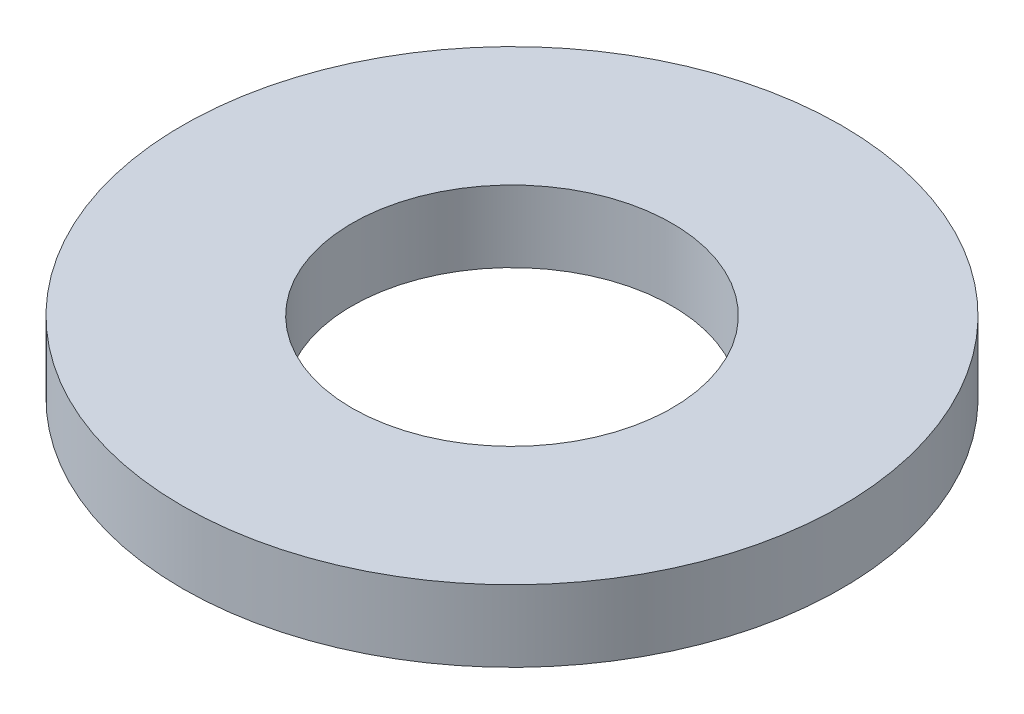
ISO-10303-21;
HEADER;
FILE_DESCRIPTION(('STEP AP214'),'2;1');
FILE_NAME('part.step','',(''),(''),'','','');
FILE_SCHEMA(('AUTOMOTIVE_DESIGN { 1 0 10303 214 1 1 1 1 }'));
ENDSEC;
DATA;
#1=APPLICATION_CONTEXT('core data for automotive mechanical design processes');
#2=APPLICATION_PROTOCOL_DEFINITION('international standard','automotive_design',2000,#1);
#3=PRODUCT_CONTEXT('',#1,'mechanical');
#4=PRODUCT('Part','Part','',(#3));
#5=PRODUCT_RELATED_PRODUCT_CATEGORY('part','',(#4));
#6=PRODUCT_DEFINITION_FORMATION('','',#4);
#7=PRODUCT_DEFINITION_CONTEXT('part definition',#1,'design');
#8=PRODUCT_DEFINITION('design','',#6,#7);
#9=PRODUCT_DEFINITION_SHAPE('','',#8);
#10=(LENGTH_UNIT() NAMED_UNIT(*) SI_UNIT(.MILLI.,.METRE.));
#11=(NAMED_UNIT(*) PLANE_ANGLE_UNIT() SI_UNIT($,.RADIAN.));
#12=(NAMED_UNIT(*) SI_UNIT($,.STERADIAN.) SOLID_ANGLE_UNIT());
#13=UNCERTAINTY_MEASURE_WITH_UNIT(LENGTH_MEASURE(1.E-05),#10,'distance_accuracy_value','');
#14=(GEOMETRIC_REPRESENTATION_CONTEXT(3) GLOBAL_UNCERTAINTY_ASSIGNED_CONTEXT((#13)) GLOBAL_UNIT_ASSIGNED_CONTEXT((#10,
#11,#12)) REPRESENTATION_CONTEXT('',''));
#15=CARTESIAN_POINT('',(0.,0.,0.));
#16=DIRECTION('',(0.,0.,1.));
#17=DIRECTION('',(1.,0.,0.));
#18=AXIS2_PLACEMENT_3D('',#15,#16,#17);
#19=CARTESIAN_POINT('',(0.,19.,0.));
#20=DIRECTION('',(0.,-1.,0.));
#21=DIRECTION('',(0.,0.,-1.));
#22=AXIS2_PLACEMENT_3D('',#19,#20,#21);
#23=CYLINDRICAL_SURFACE('',#22,87.5);
#24=CARTESIAN_POINT('',(0.,19.,0.));
#25=DIRECTION('',(0.,1.,0.));
#26=DIRECTION('',(0.,0.,1.));
#27=AXIS2_PLACEMENT_3D('',#24,#25,#26);
#28=CIRCLE('',#27,87.5);
#29=CARTESIAN_POINT('',(0.,19.,87.5));
#30=VERTEX_POINT('',#29);
#31=EDGE_CURVE('E10',#30,#30,#28,.T.);
#32=ORIENTED_EDGE('',*,*,#31,.F.);
#33=EDGE_LOOP('',(#32));
#34=FACE_BOUND('',#33,.T.);
#35=CARTESIAN_POINT('',(0.,0.,0.));
#36=DIRECTION('',(0.,1.,0.));
#37=DIRECTION('',(0.,0.,1.));
#38=AXIS2_PLACEMENT_3D('',#35,#36,#37);
#39=CIRCLE('',#38,87.5);
#40=CARTESIAN_POINT('',(0.,0.,87.5));
#41=VERTEX_POINT('',#40);
#42=EDGE_CURVE('E37',#41,#41,#39,.T.);
#43=ORIENTED_EDGE('',*,*,#42,.T.);
#44=EDGE_LOOP('',(#43));
#45=FACE_BOUND('',#44,.T.);
#46=ADVANCED_FACE('F40',(#34,#45),#23,.T.);
#47=CARTESIAN_POINT('',(0.,19.,0.));
#48=DIRECTION('',(0.,1.,0.));
#49=DIRECTION('',(0.,0.,1.));
#50=AXIS2_PLACEMENT_3D('',#47,#48,#49);
#51=PLANE('',#50);
#52=CARTESIAN_POINT('',(0.,19.,0.));
#53=DIRECTION('',(0.,1.,0.));
#54=DIRECTION('',(0.,0.,1.));
#55=AXIS2_PLACEMENT_3D('',#52,#53,#54);
#56=CIRCLE('',#55,42.5);
#57=CARTESIAN_POINT('',(0.,19.,42.5));
#58=VERTEX_POINT('',#57);
#59=EDGE_CURVE('E50',#58,#58,#56,.T.);
#60=ORIENTED_EDGE('',*,*,#59,.F.);
#61=EDGE_LOOP('',(#60));
#62=FACE_BOUND('',#61,.T.);
#63=ORIENTED_EDGE('',*,*,#31,.T.);
#64=EDGE_LOOP('',(#63));
#65=FACE_BOUND('',#64,.T.);
#66=ADVANCED_FACE('F59',(#62,#65),#51,.T.);
#67=CARTESIAN_POINT('',(0.,0.,0.));
#68=DIRECTION('',(0.,1.,0.));
#69=DIRECTION('',(0.,0.,1.));
#70=AXIS2_PLACEMENT_3D('',#67,#68,#69);
#71=PLANE('',#70);
#72=CARTESIAN_POINT('',(0.,0.,0.));
#73=DIRECTION('',(0.,1.,0.));
#74=DIRECTION('',(0.,0.,1.));
#75=AXIS2_PLACEMENT_3D('',#72,#73,#74);
#76=CIRCLE('',#75,42.5);
#77=CARTESIAN_POINT('',(0.,0.,42.5));
#78=VERTEX_POINT('',#77);
#79=EDGE_CURVE('E47',#78,#78,#76,.T.);
#80=ORIENTED_EDGE('',*,*,#79,.T.);
#81=EDGE_LOOP('',(#80));
#82=FACE_BOUND('',#81,.T.);
#83=ORIENTED_EDGE('',*,*,#42,.F.);
#84=EDGE_LOOP('',(#83));
#85=FACE_BOUND('',#84,.T.);
#86=ADVANCED_FACE('F58',(#82,#85),#71,.F.);
#87=CARTESIAN_POINT('',(0.,19.,0.));
#88=DIRECTION('',(0.,-1.,0.));
#89=DIRECTION('',(0.,0.,-1.));
#90=AXIS2_PLACEMENT_3D('',#87,#88,#89);
#91=CYLINDRICAL_SURFACE('',#90,42.5);
#92=ORIENTED_EDGE('',*,*,#59,.T.);
#93=EDGE_LOOP('',(#92));
#94=FACE_BOUND('',#93,.T.);
#95=ORIENTED_EDGE('',*,*,#79,.F.);
#96=EDGE_LOOP('',(#95));
#97=FACE_BOUND('',#96,.T.);
#98=ADVANCED_FACE('F54',(#94,#97),#91,.F.);
#99=CLOSED_SHELL('',(#46,#66,#86,#98));
#100=MANIFOLD_SOLID_BREP('B2',#99);
#101=ADVANCED_BREP_SHAPE_REPRESENTATION('',(#18,#100),#14);
#102=SHAPE_DEFINITION_REPRESENTATION(#9,#101);
ENDSEC;
END-ISO-10303-21;
